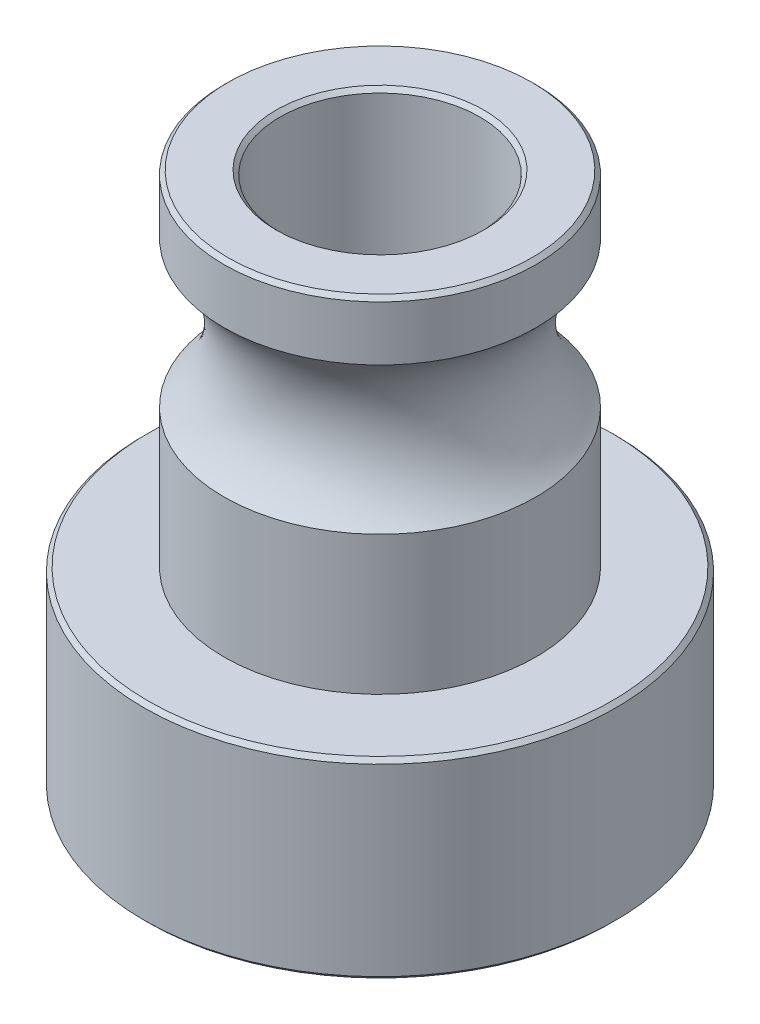
ISO-10303-21;
HEADER;
FILE_DESCRIPTION(('STEP AP214'),'2;1');
FILE_NAME('part.step','',(''),(''),'','','');
FILE_SCHEMA(('AUTOMOTIVE_DESIGN { 1 0 10303 214 1 1 1 1 }'));
ENDSEC;
DATA;
#1=APPLICATION_CONTEXT('core data for automotive mechanical design processes');
#2=APPLICATION_PROTOCOL_DEFINITION('international standard','automotive_design',2000,#1);
#3=PRODUCT_CONTEXT('',#1,'mechanical');
#4=PRODUCT('Part','Part','',(#3));
#5=PRODUCT_RELATED_PRODUCT_CATEGORY('part','',(#4));
#6=PRODUCT_DEFINITION_FORMATION('','',#4);
#7=PRODUCT_DEFINITION_CONTEXT('part definition',#1,'design');
#8=PRODUCT_DEFINITION('design','',#6,#7);
#9=PRODUCT_DEFINITION_SHAPE('','',#8);
#10=(LENGTH_UNIT() NAMED_UNIT(*) SI_UNIT(.MILLI.,.METRE.));
#11=(NAMED_UNIT(*) PLANE_ANGLE_UNIT() SI_UNIT($,.RADIAN.));
#12=(NAMED_UNIT(*) SI_UNIT($,.STERADIAN.) SOLID_ANGLE_UNIT());
#13=UNCERTAINTY_MEASURE_WITH_UNIT(LENGTH_MEASURE(1.E-05),#10,'distance_accuracy_value','');
#14=(GEOMETRIC_REPRESENTATION_CONTEXT(3) GLOBAL_UNCERTAINTY_ASSIGNED_CONTEXT((#13)) GLOBAL_UNIT_ASSIGNED_CONTEXT((#10,
#11,#12)) REPRESENTATION_CONTEXT('',''));
#15=CARTESIAN_POINT('',(0.,0.,0.));
#16=DIRECTION('',(0.,0.,1.));
#17=DIRECTION('',(1.,0.,0.));
#18=AXIS2_PLACEMENT_3D('',#15,#16,#17);
#19=CARTESIAN_POINT('',(0.,13.4,0.));
#20=DIRECTION('',(0.,-1.,0.));
#21=DIRECTION('',(0.,0.,-1.));
#22=AXIS2_PLACEMENT_3D('',#19,#20,#21);
#23=CYLINDRICAL_SURFACE('',#22,3.9);
#24=CARTESIAN_POINT('',(0.,11.9330302779823,0.));
#25=DIRECTION('',(0.,-1.,0.));
#26=DIRECTION('',(0.,0.,-1.));
#27=AXIS2_PLACEMENT_3D('',#24,#25,#26);
#28=CIRCLE('',#27,3.9);
#29=CARTESIAN_POINT('',(0.,11.9330302779823,-3.9));
#30=VERTEX_POINT('',#29);
#31=EDGE_CURVE('E53',#30,#30,#28,.F.);
#32=ORIENTED_EDGE('',*,*,#31,.T.);
#33=EDGE_LOOP('',(#32));
#34=FACE_BOUND('',#33,.T.);
#35=CARTESIAN_POINT('',(0.,13.3,0.));
#36=DIRECTION('',(0.,1.,0.));
#37=DIRECTION('',(0.,0.,1.));
#38=AXIS2_PLACEMENT_3D('',#35,#36,#37);
#39=CIRCLE('',#38,3.9);
#40=CARTESIAN_POINT('',(0.,13.3,3.9));
#41=VERTEX_POINT('',#40);
#42=EDGE_CURVE('E10',#41,#41,#39,.F.);
#43=ORIENTED_EDGE('',*,*,#42,.T.);
#44=EDGE_LOOP('',(#43));
#45=FACE_BOUND('',#44,.T.);
#46=ADVANCED_FACE('F30',(#34,#45),#23,.T.);
#47=CARTESIAN_POINT('',(0.,4.8,0.));
#48=DIRECTION('',(0.,1.,0.));
#49=DIRECTION('',(0.,0.,1.));
#50=AXIS2_PLACEMENT_3D('',#47,#48,#49);
#51=PLANE('',#50);
#52=CARTESIAN_POINT('',(0.,4.8,0.));
#53=DIRECTION('',(0.,1.,0.));
#54=DIRECTION('',(0.,0.,1.));
#55=AXIS2_PLACEMENT_3D('',#52,#53,#54);
#56=CIRCLE('',#55,5.8);
#57=CARTESIAN_POINT('',(0.,4.8,5.8));
#58=VERTEX_POINT('',#57);
#59=EDGE_CURVE('E86',#58,#58,#56,.T.);
#60=ORIENTED_EDGE('',*,*,#59,.T.);
#61=EDGE_LOOP('',(#60));
#62=FACE_BOUND('',#61,.T.);
#63=CARTESIAN_POINT('',(0.,4.8,0.));
#64=DIRECTION('',(0.,1.,0.));
#65=DIRECTION('',(0.,0.,1.));
#66=AXIS2_PLACEMENT_3D('',#63,#64,#65);
#67=CIRCLE('',#66,3.9);
#68=CARTESIAN_POINT('',(0.,4.8,3.9));
#69=VERTEX_POINT('',#68);
#70=EDGE_CURVE('E56',#69,#69,#67,.F.);
#71=ORIENTED_EDGE('',*,*,#70,.T.);
#72=EDGE_LOOP('',(#71));
#73=FACE_BOUND('',#72,.T.);
#74=ADVANCED_FACE('F107',(#62,#73),#51,.T.);
#75=CARTESIAN_POINT('',(0.,4.8,0.));
#76=DIRECTION('',(0.,-1.,0.));
#77=DIRECTION('',(0.,0.,-1.));
#78=AXIS2_PLACEMENT_3D('',#75,#76,#77);
#79=CYLINDRICAL_SURFACE('',#78,5.9);
#80=CARTESIAN_POINT('',(0.,3.9,-5.9));
#81=CARTESIAN_POINT('',(-0.0828300382499491,3.89999776004633,-5.89999863185022));
#82=CARTESIAN_POINT('',(-0.165684832863688,3.89311612318012,-5.89823839931484));
#83=CARTESIAN_POINT('',(-0.329016763273004,3.86581448398174,-5.89138713946882));
#84=CARTESIAN_POINT('',(-0.409492577152412,3.84538709715845,-5.88629429539872));
#85=CARTESIAN_POINT('',(-0.565684557209916,3.79169407311897,-5.87334130935857));
#86=CARTESIAN_POINT('',(-0.641406413346793,3.75844413735725,-5.86548455288059));
#87=CARTESIAN_POINT('',(-0.786197875180383,3.68010584238721,-5.84783888653407));
#88=CARTESIAN_POINT('',(-0.855267201012285,3.63501698542525,-5.83804989543126));
#89=CARTESIAN_POINT('',(-0.986260236282176,3.53326913337726,-5.81736852160734));
#90=CARTESIAN_POINT('',(-1.04802249224729,3.47640582402486,-5.80645865200954));
#91=CARTESIAN_POINT('',(-1.16124449896803,3.35316047491362,-5.78488032866515));
#92=CARTESIAN_POINT('',(-1.21270304730156,3.286777325758,-5.77421190322332));
#93=CARTESIAN_POINT('',(-1.30462316017259,3.14511432940565,-5.75414745591023));
#94=CARTESIAN_POINT('',(-1.34490284311052,3.0697130400231,-5.74477360042579));
#95=CARTESIAN_POINT('',(-1.4121517223974,2.91293235224187,-5.72861518109046));
#96=CARTESIAN_POINT('',(-1.43912312697355,2.83155394819512,-5.72183018771507));
#97=CARTESIAN_POINT('',(-1.47843656787613,2.6669076213725,-5.71179764583944));
#98=CARTESIAN_POINT('',(-1.49106951185751,2.58371354015589,-5.70847986708464));
#99=CARTESIAN_POINT('',(-1.5022537680738,2.41632581258751,-5.70554728281267));
#100=CARTESIAN_POINT('',(-1.50080745483598,2.33213233718008,-5.70593185287833));
#101=CARTESIAN_POINT('',(-1.48410606772934,2.16737543711391,-5.71029745273476));
#102=CARTESIAN_POINT('',(-1.46919896212241,2.08677396064833,-5.71418785001937));
#103=CARTESIAN_POINT('',(-1.42655478807359,1.92925523731394,-5.72498214747374));
#104=CARTESIAN_POINT('',(-1.39881677783028,1.85233826134863,-5.73188626885181));
#105=CARTESIAN_POINT('',(-1.33100488852097,1.70344535532072,-5.74801240949616));
#106=CARTESIAN_POINT('',(-1.29080579577386,1.63152908741831,-5.75725777350398));
#107=CARTESIAN_POINT('',(-1.19930036134028,1.49533872198307,-5.77701165833937));
#108=CARTESIAN_POINT('',(-1.14799201509948,1.43106600690019,-5.78752040697974));
#109=CARTESIAN_POINT('',(-1.03392786808934,1.30999460562336,-5.80899752020269));
#110=CARTESIAN_POINT('',(-0.970878777414768,1.25347265928712,-5.81997029361514));
#111=CARTESIAN_POINT('',(-0.836064673045031,1.15175065658456,-5.84085966687947));
#112=CARTESIAN_POINT('',(-0.764299375001822,1.10655096973068,-5.85077623225495));
#113=CARTESIAN_POINT('',(-0.613686789621631,1.02864993623717,-5.86848800026142));
#114=CARTESIAN_POINT('',(-0.534814607701237,0.995994813481357,-5.87627532733138));
#115=CARTESIAN_POINT('',(-0.372457781193937,0.944484804760257,-5.888794022969));
#116=CARTESIAN_POINT('',(-0.288974053507842,0.92562718602176,-5.89352599666688));
#117=CARTESIAN_POINT('',(-0.122128930978259,0.902673070086438,-5.899310781984));
#118=CARTESIAN_POINT('',(-0.0388225405440695,0.898199864365767,-5.90045746482781));
#119=CARTESIAN_POINT('',(0.127348889786347,0.90310657247616,-5.89921045786372));
#120=CARTESIAN_POINT('',(0.210213970139116,0.912485193729442,-5.89681709839345));
#121=CARTESIAN_POINT('',(0.371832681358253,0.944519179062777,-5.88881920506323));
#122=CARTESIAN_POINT('',(0.450629972839558,0.966967886861967,-5.88326468368383));
#123=CARTESIAN_POINT('',(0.603335371703896,1.02426778466471,-5.86957144444429));
#124=CARTESIAN_POINT('',(0.677242974838862,1.05912025144638,-5.8614324605624));
#125=CARTESIAN_POINT('',(0.819561135349217,1.14096058297322,-5.84324947975955));
#126=CARTESIAN_POINT('',(0.887847038351112,1.18815793594376,-5.83317348261169));
#127=CARTESIAN_POINT('',(1.01566287928876,1.29308162056905,-5.81228271270935));
#128=CARTESIAN_POINT('',(1.07519124827461,1.35080983473332,-5.80146780808341));
#129=CARTESIAN_POINT('',(1.18536341320321,1.47690799290363,-5.77997834225627));
#130=CARTESIAN_POINT('',(1.23574255151291,1.54551137083902,-5.7693143569736));
#131=CARTESIAN_POINT('',(1.32427465688686,1.69041961124065,-5.74964010495377));
#132=CARTESIAN_POINT('',(1.36242816150323,1.76672413489914,-5.74062976551446));
#133=CARTESIAN_POINT('',(1.42514033179541,1.92446471067399,-5.72538357168284));
#134=CARTESIAN_POINT('',(1.44977937476193,2.00586714296086,-5.71913135785691));
#135=CARTESIAN_POINT('',(1.484970272922,2.17184312783711,-5.71009628596941));
#136=CARTESIAN_POINT('',(1.49552533544564,2.25641595392426,-5.70731263802452));
#137=CARTESIAN_POINT('',(1.50207678454967,2.4236348791933,-5.70559153423418));
#138=CARTESIAN_POINT('',(1.49849674160241,2.50626349266575,-5.70654217289633));
#139=CARTESIAN_POINT('',(1.47785227797149,2.6696972947885,-5.71192298396535));
#140=CARTESIAN_POINT('',(1.4607881464442,2.75050252250174,-5.71635308175778));
#141=CARTESIAN_POINT('',(1.41389485565978,2.90751722373181,-5.72813020683422));
#142=CARTESIAN_POINT('',(1.38414770718958,2.98375269479213,-5.73545847233807));
#143=CARTESIAN_POINT('',(1.3127973032129,3.13020606085726,-5.75220828882475));
#144=CARTESIAN_POINT('',(1.27119234814895,3.20042309137224,-5.76163013983463));
#145=CARTESIAN_POINT('',(1.17599044237874,3.33488701579663,-5.78182245060816));
#146=CARTESIAN_POINT('',(1.12210078652748,3.39892227713735,-5.79262238972102));
#147=CARTESIAN_POINT('',(1.00442620910812,3.5171786035931,-5.81418091410334));
#148=CARTESIAN_POINT('',(0.94063892839525,3.57139732219611,-5.82493948888527));
#149=CARTESIAN_POINT('',(0.803524205218609,3.66948314191348,-5.84544595559965));
#150=CARTESIAN_POINT('',(0.730039189018958,3.71313514277243,-5.8551708925873));
#151=CARTESIAN_POINT('',(0.576532096973004,3.78739656173201,-5.8722700689399));
#152=CARTESIAN_POINT('',(0.496514631891311,3.81801508593472,-5.87964594861095));
#153=CARTESIAN_POINT('',(0.347230792472994,3.86093144239924,-5.89015920699172));
#154=CARTESIAN_POINT('',(0.278659436649341,3.8755499081574,-5.89382377720494));
#155=CARTESIAN_POINT('',(0.140064542759633,3.89508474275635,-5.89874465504578));
#156=CARTESIAN_POINT('',(0.0700411222776748,3.90000189410596,-5.90000115690815));
#157=CARTESIAN_POINT('',(0.,3.9,-5.9));
#158=B_SPLINE_CURVE_WITH_KNOTS('',3,(#80,#81,#82,#83,#84,#85,#86,#87,#88,#89,#90,#91,#92,#93,
#94,#95,#96,#97,#98,#99,#100,#101,#102,#103,#104,#105,#106,#107,#108,#109,#110,#111,#112,#113,
#114,#115,#116,#117,#118,#119,#120,#121,#122,#123,#124,#125,#126,#127,#128,#129,#130,#131,#132,
#133,#134,#135,#136,#137,#138,#139,#140,#141,#142,#143,#144,#145,#146,#147,#148,#149,#150,#151,
#152,#153,#154,#155,#156,#157),.UNSPECIFIED.,.T.,.F.,(4,2,2,2,2,2,2,2,2,2,2,2,2,2,2,2,2,2,2,2,2,
2,2,2,2,2,2,2,2,2,2,2,2,2,2,2,2,2,4),(0.,0.248233394491255,0.496602225258984,0.744667884467357,
0.992743974977817,1.2455526134713,1.49839073705538,1.75512908076637,2.01182480984364,
2.26321383822943,2.51456046950916,2.7595900223528,3.00463756346887,3.25223194832833,
3.4998710464196,3.75482258942745,4.00978245193162,4.26567297297126,4.52151279787067,
4.77059551627814,5.01965499309823,5.26487950095513,5.51012925824523,5.7598463644529,
6.00960815421591,6.26572614204238,6.52183286700362,6.77639940759489,7.03090796611494,
7.27784869958148,7.52478413772931,7.77014649916531,8.01554404563502,8.26754847835888,
8.51961307003948,8.77644345520998,9.03309410493866,9.24301732210762,9.45292360616002),.UNSPECIFIED.);
#159=CARTESIAN_POINT('',(0.,3.9,-5.9));
#160=VERTEX_POINT('',#159);
#161=EDGE_CURVE('E54',#160,#160,#158,.T.);
#162=ORIENTED_EDGE('',*,*,#161,.T.);
#163=EDGE_LOOP('',(#162));
#164=FACE_BOUND('',#163,.T.);
#165=CARTESIAN_POINT('',(0.,0.0999999999999985,0.));
#166=DIRECTION('',(0.,1.,0.));
#167=DIRECTION('',(0.,0.,1.));
#168=AXIS2_PLACEMENT_3D('',#165,#166,#167);
#169=CIRCLE('',#168,5.9);
#170=CARTESIAN_POINT('',(0.,0.0999999999999985,5.9));
#171=VERTEX_POINT('',#170);
#172=EDGE_CURVE('E83',#171,#171,#169,.T.);
#173=ORIENTED_EDGE('',*,*,#172,.T.);
#174=EDGE_LOOP('',(#173));
#175=FACE_BOUND('',#174,.T.);
#176=CARTESIAN_POINT('',(0.,4.7,0.));
#177=DIRECTION('',(0.,1.,0.));
#178=DIRECTION('',(0.,0.,1.));
#179=AXIS2_PLACEMENT_3D('',#176,#177,#178);
#180=CIRCLE('',#179,5.9);
#181=CARTESIAN_POINT('',(0.,4.7,5.9));
#182=VERTEX_POINT('',#181);
#183=EDGE_CURVE('E80',#182,#182,#180,.F.);
#184=ORIENTED_EDGE('',*,*,#183,.T.);
#185=EDGE_LOOP('',(#184));
#186=FACE_BOUND('',#185,.T.);
#187=ADVANCED_FACE('F113',(#164,#175,#186),#79,.T.);
#188=CARTESIAN_POINT('',(0.,0.,0.));
#189=DIRECTION('',(0.,1.,0.));
#190=DIRECTION('',(0.,0.,1.));
#191=AXIS2_PLACEMENT_3D('',#188,#189,#190);
#192=PLANE('',#191);
#193=CARTESIAN_POINT('',(0.,0.,0.));
#194=DIRECTION('',(0.,1.,0.));
#195=DIRECTION('',(0.,0.,1.));
#196=AXIS2_PLACEMENT_3D('',#193,#194,#195);
#197=CIRCLE('',#196,2.6);
#198=CARTESIAN_POINT('',(0.,0.,2.6));
#199=VERTEX_POINT('',#198);
#200=EDGE_CURVE('E65',#199,#199,#197,.T.);
#201=ORIENTED_EDGE('',*,*,#200,.T.);
#202=EDGE_LOOP('',(#201));
#203=FACE_BOUND('',#202,.T.);
#204=CARTESIAN_POINT('',(0.,0.,0.));
#205=DIRECTION('',(0.,1.,0.));
#206=DIRECTION('',(0.,0.,1.));
#207=AXIS2_PLACEMENT_3D('',#204,#205,#206);
#208=CIRCLE('',#207,5.8);
#209=CARTESIAN_POINT('',(0.,0.,5.8));
#210=VERTEX_POINT('',#209);
#211=EDGE_CURVE('E60',#210,#210,#208,.F.);
#212=ORIENTED_EDGE('',*,*,#211,.T.);
#213=EDGE_LOOP('',(#212));
#214=FACE_BOUND('',#213,.T.);
#215=ADVANCED_FACE('F118',(#203,#214),#192,.F.);
#216=CARTESIAN_POINT('',(0.,8.26696972201766,0.));
#217=DIRECTION('',(0.,1.,0.));
#218=DIRECTION('',(0.,0.,1.));
#219=AXIS2_PLACEMENT_3D('',#216,#217,#218);
#220=CIRCLE('',#219,3.9);
#221=CARTESIAN_POINT('',(0.,8.26696972201766,3.9));
#222=VERTEX_POINT('',#221);
#223=EDGE_CURVE('E51',#222,#222,#220,.F.);
#224=ORIENTED_EDGE('',*,*,#223,.T.);
#225=EDGE_LOOP('',(#224));
#226=FACE_BOUND('',#225,.T.);
#227=ORIENTED_EDGE('',*,*,#70,.F.);
#228=EDGE_LOOP('',(#227));
#229=FACE_BOUND('',#228,.T.);
#230=ADVANCED_FACE('F109',(#226,#229),#23,.T.);
#231=CARTESIAN_POINT('',(0.,13.4,0.));
#232=DIRECTION('',(0.,1.,0.));
#233=DIRECTION('',(0.,0.,1.));
#234=AXIS2_PLACEMENT_3D('',#231,#232,#233);
#235=PLANE('',#234);
#236=CARTESIAN_POINT('',(0.,13.4,0.));
#237=DIRECTION('',(0.,1.,0.));
#238=DIRECTION('',(0.,0.,1.));
#239=AXIS2_PLACEMENT_3D('',#236,#237,#238);
#240=CIRCLE('',#239,2.6);
#241=CARTESIAN_POINT('',(0.,13.4,2.6));
#242=VERTEX_POINT('',#241);
#243=EDGE_CURVE('E42',#242,#242,#240,.F.);
#244=ORIENTED_EDGE('',*,*,#243,.T.);
#245=EDGE_LOOP('',(#244));
#246=FACE_BOUND('',#245,.T.);
#247=CARTESIAN_POINT('',(0.,13.4,0.));
#248=DIRECTION('',(0.,1.,0.));
#249=DIRECTION('',(0.,0.,1.));
#250=AXIS2_PLACEMENT_3D('',#247,#248,#249);
#251=CIRCLE('',#250,3.8);
#252=CARTESIAN_POINT('',(0.,13.4,3.8));
#253=VERTEX_POINT('',#252);
#254=EDGE_CURVE('E47',#253,#253,#251,.T.);
#255=ORIENTED_EDGE('',*,*,#254,.T.);
#256=EDGE_LOOP('',(#255));
#257=FACE_BOUND('',#256,.T.);
#258=ADVANCED_FACE('F91',(#246,#257),#235,.T.);
#259=CARTESIAN_POINT('',(0.,0.,0.));
#260=DIRECTION('',(0.,1.,0.));
#261=DIRECTION('',(0.,0.,1.));
#262=AXIS2_PLACEMENT_3D('',#259,#260,#261);
#263=CYLINDRICAL_SURFACE('',#262,2.5);
#264=CARTESIAN_POINT('',(1.5,2.4,-2.));
#265=CARTESIAN_POINT('',(1.50000404108592,2.32452102471036,-1.99999416642511));
#266=CARTESIAN_POINT('',(1.49426852824013,2.2490615659202,-2.00433633903481));
#267=CARTESIAN_POINT('',(1.47174965152787,2.10067609603778,-2.02092590613883));
#268=CARTESIAN_POINT('',(1.45495475788936,2.0277528126149,-2.03318155043097));
#269=CARTESIAN_POINT('',(1.41143486335795,1.88691635832272,-2.0636233903473));
#270=CARTESIAN_POINT('',(1.3847815450315,1.81897116196473,-2.0817666618312));
#271=CARTESIAN_POINT('',(1.32252909283019,1.68856254663208,-2.12185904995836));
#272=CARTESIAN_POINT('',(1.28692729054693,1.62610077030486,-2.14380930122416));
#273=CARTESIAN_POINT('',(1.20271292747644,1.50005098333592,-2.19228594587542));
#274=CARTESIAN_POINT('',(1.15304179435289,1.43725904287606,-2.21904371037662));
#275=CARTESIAN_POINT('',(1.04426801309985,1.32023523725825,-2.27226229431061));
#276=CARTESIAN_POINT('',(0.985158296729613,1.2660098483292,-2.29872287517103));
#277=CARTESIAN_POINT('',(0.851442367411702,1.16186619029031,-2.35175567858734));
#278=CARTESIAN_POINT('',(0.775851995162548,1.11304553633025,-2.37803133577818));
#279=CARTESIAN_POINT('',(0.615654228271659,1.02919027755557,-2.42443786983179));
#280=CARTESIAN_POINT('',(0.531055196626331,0.994143025877287,-2.44457437988735));
#281=CARTESIAN_POINT('',(0.363771406742667,0.942404077187353,-2.4747098780044));
#282=CARTESIAN_POINT('',(0.281674698130916,0.924279639032704,-2.4854930393917));
#283=CARTESIAN_POINT('',(0.114970509382708,0.90205719713688,-2.49874939277545));
#284=CARTESIAN_POINT('',(0.0303654624001537,0.897946021999946,-2.50123038813307));
#285=CARTESIAN_POINT('',(-0.127637283737309,0.903613747342461,-2.49783372711539));
#286=CARTESIAN_POINT('',(-0.201123832865634,0.911733526169313,-2.49295437513726));
#287=CARTESIAN_POINT('',(-0.345464269151768,0.938479795648107,-2.47707997553857));
#288=CARTESIAN_POINT('',(-0.416317961051201,0.957107063907155,-2.46608447529309));
#289=CARTESIAN_POINT('',(-0.554056780469079,1.00416556270378,-2.43884907201719));
#290=CARTESIAN_POINT('',(-0.620916491037617,1.032653061139,-2.42257910450824));
#291=CARTESIAN_POINT('',(-0.748988660115611,1.09838461622554,-2.38609637638748));
#292=CARTESIAN_POINT('',(-0.810199646208011,1.13563094705901,-2.36588259201812));
#293=CARTESIAN_POINT('',(-0.933074267143199,1.22283909280445,-2.32037925976363));
#294=CARTESIAN_POINT('',(-0.993918663198193,1.27378831173574,-2.2947718295215));
#295=CARTESIAN_POINT('',(-1.10671465909275,1.38440411786018,-2.24255554245601));
#296=CARTESIAN_POINT('',(-1.1586540130834,1.44408250347451,-2.21594536703375));
#297=CARTESIAN_POINT('',(-1.25824837767417,1.57865340616355,-2.16111075123946));
#298=CARTESIAN_POINT('',(-1.30470933188632,1.65450757653946,-2.13305661385124));
#299=CARTESIAN_POINT('',(-1.38397217194232,1.81470623163661,-2.08250879557267));
#300=CARTESIAN_POINT('',(-1.41679921962189,1.89903471612564,-2.0600049029882));
#301=CARTESIAN_POINT('',(-1.46077497064842,2.05239363189535,-2.02895865196731));
#302=CARTESIAN_POINT('',(-1.47527903312665,2.12004063229664,-2.01833888618316));
#303=CARTESIAN_POINT('',(-1.49480872755284,2.25737361029948,-2.00392150777558));
#304=CARTESIAN_POINT('',(-1.49984538302907,2.32705712048456,-2.00011596115116));
#305=CARTESIAN_POINT('',(-1.50014781114183,2.46655168243571,-1.99988914321323));
#306=CARTESIAN_POINT('',(-1.49540004697659,2.53636277721521,-2.00347810223984));
#307=CARTESIAN_POINT('',(-1.47640290574941,2.67398734374856,-2.01751520788652));
#308=CARTESIAN_POINT('',(-1.46214601830139,2.74179919224025,-2.02796877613213));
#309=CARTESIAN_POINT('',(-1.42488312618657,2.87371457947979,-2.054317683331));
#310=CARTESIAN_POINT('',(-1.40188805257362,2.93782263653223,-2.07020622092812));
#311=CARTESIAN_POINT('',(-1.34796261057072,3.06147771573018,-2.10571539417587));
#312=CARTESIAN_POINT('',(-1.31702924888212,3.121023006366,-2.12533743689999));
#313=CARTESIAN_POINT('',(-1.24167439558512,3.24524008251225,-2.17036819177737));
#314=CARTESIAN_POINT('',(-1.19582663060303,3.30890083509657,-2.19618239397369));
#315=CARTESIAN_POINT('',(-1.09487395518701,3.42828548484946,-2.2482175480362));
#316=CARTESIAN_POINT('',(-1.03976018672402,3.48400169216912,-2.27443886711455));
#317=CARTESIAN_POINT('',(-0.913274837212767,3.59322400735043,-2.32835625910913));
#318=CARTESIAN_POINT('',(-0.840721108780192,3.64550072660584,-2.3558007587587));
#319=CARTESIAN_POINT('',(-0.686103100868021,3.73690277683665,-2.40537639133459));
#320=CARTESIAN_POINT('',(-0.604045176134703,3.77603682784092,-2.4275110444941));
#321=CARTESIAN_POINT('',(-0.438840232972139,3.83686820343137,-2.46252280092775));
#322=CARTESIAN_POINT('',(-0.356205963651259,3.85962622779111,-2.47595588067329));
#323=CARTESIAN_POINT('',(-0.187383063890858,3.89071460284626,-2.494407389061));
#324=CARTESIAN_POINT('',(-0.101198571781969,3.89906129071762,-2.49943534582737));
#325=CARTESIAN_POINT('',(0.0598120232009838,3.90067460858593,-2.50040600461976));
#326=CARTESIAN_POINT('',(0.134620583589706,3.89580333456303,-2.49747057186327));
#327=CARTESIAN_POINT('',(0.282148755978773,3.87510617561839,-2.48512948412095));
#328=CARTESIAN_POINT('',(0.354868344701914,3.8592801686784,-2.47572375706639));
#329=CARTESIAN_POINT('',(0.495145481978797,3.81778042841621,-2.45149427526962));
#330=CARTESIAN_POINT('',(0.56276703260883,3.79226840387076,-2.43675966858906));
#331=CARTESIAN_POINT('',(0.692781971999984,3.73235940544525,-2.40303337447155));
#332=CARTESIAN_POINT('',(0.755174184199832,3.6979604391404,-2.38404073252268));
#333=CARTESIAN_POINT('',(0.880263645295947,3.61707480343124,-2.34093432659381));
#334=CARTESIAN_POINT('',(0.94225869043994,3.56968129098313,-2.31648844639149));
#335=CARTESIAN_POINT('',(1.05789751536307,3.46624696628228,-2.26601907350661));
#336=CARTESIAN_POINT('',(1.11153190956916,3.41019657439209,-2.23999385274509));
#337=CARTESIAN_POINT('',(1.2159097535057,3.2827144378223,-2.18528165666204));
#338=CARTESIAN_POINT('',(1.26542406663367,3.2102335138345,-2.15667566270901));
#339=CARTESIAN_POINT('',(1.35156817210325,3.05651514723346,-2.10376464485145));
#340=CARTESIAN_POINT('',(1.38820466322661,2.97528228601859,-2.07945738811052));
#341=CARTESIAN_POINT('',(1.44437116535132,2.8129357148628,-2.0408000304796));
#342=CARTESIAN_POINT('',(1.46509526060187,2.73240476403875,-2.02577665830138));
#343=CARTESIAN_POINT('',(1.49289268240426,2.56790260529632,-2.00539032320036));
#344=CARTESIAN_POINT('',(1.49999550595837,2.48393923424129,-2.00000648744643));
#345=CARTESIAN_POINT('',(1.5,2.4,-2.));
#346=B_SPLINE_CURVE_WITH_KNOTS('',3,(#264,#265,#266,#267,#268,#269,#270,#271,#272,#273,#274,
#275,#276,#277,#278,#279,#280,#281,#282,#283,#284,#285,#286,#287,#288,#289,#290,#291,#292,#293,
#294,#295,#296,#297,#298,#299,#300,#301,#302,#303,#304,#305,#306,#307,#308,#309,#310,#311,#312,
#313,#314,#315,#316,#317,#318,#319,#320,#321,#322,#323,#324,#325,#326,#327,#328,#329,#330,#331,
#332,#333,#334,#335,#336,#337,#338,#339,#340,#341,#342,#343,#344,#345),.UNSPECIFIED.,.T.,.F.,(4,
2,2,2,2,2,2,2,2,2,2,2,2,2,2,2,2,2,2,2,2,2,2,2,2,2,2,2,2,2,2,2,2,2,2,2,2,2,2,2,4),(0.,
0.226085249493392,0.45240657433077,0.677113624991876,0.901887762215932,1.15414462390001,
1.40659128601844,1.68630157736223,1.9657544327122,2.21853330858497,2.47107452602766,
2.69230130543181,2.91354445887944,3.13607155036377,3.35865648368878,3.60782810055849,
3.85733966656908,4.13576671140276,4.41367760154768,4.62276298054684,4.83160475643976,
5.04073566011181,5.25003193304128,5.45906724365495,5.66818149154661,5.91499438482002,
6.16204457978454,6.44121828011588,6.72020638384847,6.97891479383337,7.23732973022726,
7.46129321849399,7.68525920139648,7.90563970188756,8.12606965394584,8.37042963549487,
8.61506198741955,8.89071695766604,9.16622832484805,9.41820120134354,9.66962780912277),.UNSPECIFIED.);
#347=CARTESIAN_POINT('',(1.5,2.4,-2.));
#348=VERTEX_POINT('',#347);
#349=EDGE_CURVE('E34',#348,#348,#346,.T.);
#350=ORIENTED_EDGE('',*,*,#349,.T.);
#351=EDGE_LOOP('',(#350));
#352=FACE_BOUND('',#351,.T.);
#353=CARTESIAN_POINT('',(0.,0.1,0.));
#354=DIRECTION('',(0.,1.,0.));
#355=DIRECTION('',(0.,0.,1.));
#356=AXIS2_PLACEMENT_3D('',#353,#354,#355);
#357=CIRCLE('',#356,2.5);
#358=CARTESIAN_POINT('',(0.,0.1,2.5));
#359=VERTEX_POINT('',#358);
#360=EDGE_CURVE('E77',#359,#359,#357,.F.);
#361=ORIENTED_EDGE('',*,*,#360,.T.);
#362=EDGE_LOOP('',(#361));
#363=FACE_BOUND('',#362,.T.);
#364=CARTESIAN_POINT('',(0.,13.3,0.));
#365=DIRECTION('',(0.,1.,0.));
#366=DIRECTION('',(0.,0.,1.));
#367=AXIS2_PLACEMENT_3D('',#364,#365,#366);
#368=CIRCLE('',#367,2.5);
#369=CARTESIAN_POINT('',(0.,13.3,2.5));
#370=VERTEX_POINT('',#369);
#371=EDGE_CURVE('E74',#370,#370,#368,.T.);
#372=ORIENTED_EDGE('',*,*,#371,.T.);
#373=EDGE_LOOP('',(#372));
#374=FACE_BOUND('',#373,.T.);
#375=ADVANCED_FACE('F124',(#352,#363,#374),#263,.F.);
#376=CARTESIAN_POINT('',(0.,0.,0.));
#377=DIRECTION('',(0.,-1.,0.));
#378=DIRECTION('',(0.,0.,-1.));
#379=AXIS2_PLACEMENT_3D('',#376,#377,#378);
#380=CONICAL_SURFACE('',#379,2.6,0.785398163397446);
#381=ORIENTED_EDGE('',*,*,#360,.F.);
#382=EDGE_LOOP('',(#381));
#383=FACE_BOUND('',#382,.T.);
#384=ORIENTED_EDGE('',*,*,#200,.F.);
#385=EDGE_LOOP('',(#384));
#386=FACE_BOUND('',#385,.T.);
#387=ADVANCED_FACE('F138',(#383,#386),#380,.F.);
#388=CARTESIAN_POINT('',(0.,0.0999999999999985,0.));
#389=DIRECTION('',(0.,1.,0.));
#390=DIRECTION('',(0.,0.,1.));
#391=AXIS2_PLACEMENT_3D('',#388,#389,#390);
#392=CONICAL_SURFACE('',#391,5.9,0.785398163397457);
#393=ORIENTED_EDGE('',*,*,#211,.F.);
#394=EDGE_LOOP('',(#393));
#395=FACE_BOUND('',#394,.T.);
#396=ORIENTED_EDGE('',*,*,#172,.F.);
#397=EDGE_LOOP('',(#396));
#398=FACE_BOUND('',#397,.T.);
#399=ADVANCED_FACE('F141',(#395,#398),#392,.T.);
#400=CARTESIAN_POINT('',(0.,4.8,0.));
#401=DIRECTION('',(0.,-1.,0.));
#402=DIRECTION('',(0.,0.,-1.));
#403=AXIS2_PLACEMENT_3D('',#400,#401,#402);
#404=CONICAL_SURFACE('',#403,5.8,0.785398163397457);
#405=ORIENTED_EDGE('',*,*,#183,.F.);
#406=EDGE_LOOP('',(#405));
#407=FACE_BOUND('',#406,.T.);
#408=ORIENTED_EDGE('',*,*,#59,.F.);
#409=EDGE_LOOP('',(#408));
#410=FACE_BOUND('',#409,.T.);
#411=ADVANCED_FACE('F104',(#407,#410),#404,.T.);
#412=CARTESIAN_POINT('',(0.,13.3,0.));
#413=DIRECTION('',(0.,1.,0.));
#414=DIRECTION('',(0.,0.,1.));
#415=AXIS2_PLACEMENT_3D('',#412,#413,#414);
#416=CONICAL_SURFACE('',#415,2.5,0.785398163397442);
#417=ORIENTED_EDGE('',*,*,#243,.F.);
#418=EDGE_LOOP('',(#417));
#419=FACE_BOUND('',#418,.T.);
#420=ORIENTED_EDGE('',*,*,#371,.F.);
#421=EDGE_LOOP('',(#420));
#422=FACE_BOUND('',#421,.T.);
#423=ADVANCED_FACE('F95',(#419,#422),#416,.F.);
#424=CARTESIAN_POINT('',(0.,13.4,0.));
#425=DIRECTION('',(0.,-1.,0.));
#426=DIRECTION('',(0.,0.,-1.));
#427=AXIS2_PLACEMENT_3D('',#424,#425,#426);
#428=CONICAL_SURFACE('',#427,3.8,0.785398163397438);
#429=ORIENTED_EDGE('',*,*,#42,.F.);
#430=EDGE_LOOP('',(#429));
#431=FACE_BOUND('',#430,.T.);
#432=ORIENTED_EDGE('',*,*,#254,.F.);
#433=EDGE_LOOP('',(#432));
#434=FACE_BOUND('',#433,.T.);
#435=ADVANCED_FACE('F32',(#431,#434),#428,.T.);
#436=CARTESIAN_POINT('',(0.,10.1,0.));
#437=DIRECTION('',(0.,1.,0.));
#438=DIRECTION('',(0.,0.,1.));
#439=AXIS2_PLACEMENT_3D('',#436,#437,#438);
#440=TOROIDAL_SURFACE('',#439,5.6,2.5);
#441=ORIENTED_EDGE('',*,*,#223,.F.);
#442=EDGE_LOOP('',(#441));
#443=FACE_BOUND('',#442,.T.);
#444=ORIENTED_EDGE('',*,*,#31,.F.);
#445=EDGE_LOOP('',(#444));
#446=FACE_BOUND('',#445,.T.);
#447=ADVANCED_FACE('F94',(#443,#446),#440,.F.);
#448=CARTESIAN_POINT('',(0.,2.4,-5.9));
#449=DIRECTION('',(0.,0.,1.));
#450=DIRECTION('',(1.,0.,0.));
#451=AXIS2_PLACEMENT_3D('',#448,#449,#450);
#452=CYLINDRICAL_SURFACE('',#451,1.5);
#453=ORIENTED_EDGE('',*,*,#349,.F.);
#454=EDGE_LOOP('',(#453));
#455=FACE_BOUND('',#454,.T.);
#456=ORIENTED_EDGE('',*,*,#161,.F.);
#457=EDGE_LOOP('',(#456));
#458=FACE_BOUND('',#457,.T.);
#459=ADVANCED_FACE('F101',(#455,#458),#452,.F.);
#460=CLOSED_SHELL('',(#46,#74,#187,#215,#230,#258,#375,#387,#399,#411,#423,#435,#447,#459));
#461=MANIFOLD_SOLID_BREP('B2',#460);
#462=ADVANCED_BREP_SHAPE_REPRESENTATION('',(#18,#461),#14);
#463=SHAPE_DEFINITION_REPRESENTATION(#9,#462);
ENDSEC;
END-ISO-10303-21;
